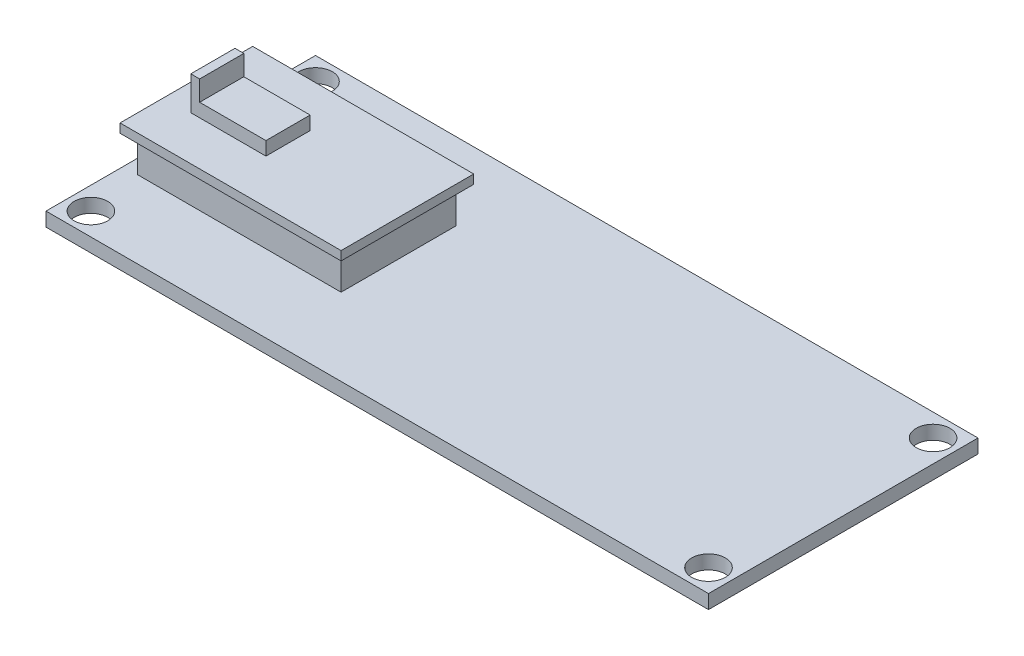
ISO-10303-21;
HEADER;
FILE_DESCRIPTION(('STEP AP214'),'2;1');
FILE_NAME('part.step','',(''),(''),'','','');
FILE_SCHEMA(('AUTOMOTIVE_DESIGN { 1 0 10303 214 1 1 1 1 }'));
ENDSEC;
DATA;
#1=APPLICATION_CONTEXT('core data for automotive mechanical design processes');
#2=APPLICATION_PROTOCOL_DEFINITION('international standard','automotive_design',2000,#1);
#3=PRODUCT_CONTEXT('',#1,'mechanical');
#4=PRODUCT('Part','Part','',(#3));
#5=PRODUCT_RELATED_PRODUCT_CATEGORY('part','',(#4));
#6=PRODUCT_DEFINITION_FORMATION('','',#4);
#7=PRODUCT_DEFINITION_CONTEXT('part definition',#1,'design');
#8=PRODUCT_DEFINITION('design','',#6,#7);
#9=PRODUCT_DEFINITION_SHAPE('','',#8);
#10=(LENGTH_UNIT() NAMED_UNIT(*) SI_UNIT(.MILLI.,.METRE.));
#11=(NAMED_UNIT(*) PLANE_ANGLE_UNIT() SI_UNIT($,.RADIAN.));
#12=(NAMED_UNIT(*) SI_UNIT($,.STERADIAN.) SOLID_ANGLE_UNIT());
#13=UNCERTAINTY_MEASURE_WITH_UNIT(LENGTH_MEASURE(1.E-05),#10,'distance_accuracy_value','');
#14=(GEOMETRIC_REPRESENTATION_CONTEXT(3) GLOBAL_UNCERTAINTY_ASSIGNED_CONTEXT((#13)) GLOBAL_UNIT_ASSIGNED_CONTEXT((#10,
#11,#12)) REPRESENTATION_CONTEXT('',''));
#15=CARTESIAN_POINT('',(0.,0.,0.));
#16=DIRECTION('',(0.,0.,1.));
#17=DIRECTION('',(1.,0.,0.));
#18=AXIS2_PLACEMENT_3D('',#15,#16,#17);
#19=CARTESIAN_POINT('',(37.465,-1.5748,15.24));
#20=DIRECTION('',(1.,0.,0.));
#21=DIRECTION('',(0.,0.,-1.));
#22=AXIS2_PLACEMENT_3D('',#19,#20,#21);
#23=PLANE('',#22);
#24=DIRECTION('',(0.,0.,-1.));
#25=VECTOR('',#24,1.);
#26=CARTESIAN_POINT('',(37.465,0.,15.24));
#27=LINE('',#26,#25);
#28=CARTESIAN_POINT('',(37.465,0.,15.24));
#29=VERTEX_POINT('',#28);
#30=CARTESIAN_POINT('',(37.465,0.,-15.24));
#31=VERTEX_POINT('',#30);
#32=EDGE_CURVE('E304',#29,#31,#27,.T.);
#33=ORIENTED_EDGE('',*,*,#32,.F.);
#34=DIRECTION('',(0.,1.,0.));
#35=VECTOR('',#34,1.);
#36=CARTESIAN_POINT('',(37.465,-1.5748,15.24));
#37=LINE('',#36,#35);
#38=CARTESIAN_POINT('',(37.465,-1.5748,15.24));
#39=VERTEX_POINT('',#38);
#40=EDGE_CURVE('E11',#39,#29,#37,.T.);
#41=ORIENTED_EDGE('',*,*,#40,.F.);
#42=DIRECTION('',(0.,0.,-1.));
#43=VECTOR('',#42,1.);
#44=CARTESIAN_POINT('',(37.465,-1.5748,15.24));
#45=LINE('',#44,#43);
#46=CARTESIAN_POINT('',(37.465,-1.5748,-15.24));
#47=VERTEX_POINT('',#46);
#48=EDGE_CURVE('E307',#39,#47,#45,.T.);
#49=ORIENTED_EDGE('',*,*,#48,.T.);
#50=DIRECTION('',(0.,1.,0.));
#51=VECTOR('',#50,1.);
#52=CARTESIAN_POINT('',(37.465,-1.5748,-15.24));
#53=LINE('',#52,#51);
#54=EDGE_CURVE('E42',#47,#31,#53,.T.);
#55=ORIENTED_EDGE('',*,*,#54,.T.);
#56=EDGE_LOOP('',(#33,#41,#49,#55));
#57=FACE_BOUND('',#56,.T.);
#58=ADVANCED_FACE('F39',(#57),#23,.T.);
#59=CARTESIAN_POINT('',(-37.465,-1.5748,15.24));
#60=DIRECTION('',(0.,0.,1.));
#61=DIRECTION('',(1.,0.,0.));
#62=AXIS2_PLACEMENT_3D('',#59,#60,#61);
#63=PLANE('',#62);
#64=DIRECTION('',(1.,0.,0.));
#65=VECTOR('',#64,1.);
#66=CARTESIAN_POINT('',(-37.465,0.,15.24));
#67=LINE('',#66,#65);
#68=CARTESIAN_POINT('',(-37.465,0.,15.24));
#69=VERTEX_POINT('',#68);
#70=EDGE_CURVE('E311',#69,#29,#67,.T.);
#71=ORIENTED_EDGE('',*,*,#70,.F.);
#72=DIRECTION('',(0.,1.,0.));
#73=VECTOR('',#72,1.);
#74=CARTESIAN_POINT('',(-37.465,-1.5748,15.24));
#75=LINE('',#74,#73);
#76=CARTESIAN_POINT('',(-37.465,-1.5748,15.24));
#77=VERTEX_POINT('',#76);
#78=EDGE_CURVE('E47',#77,#69,#75,.T.);
#79=ORIENTED_EDGE('',*,*,#78,.F.);
#80=DIRECTION('',(1.,0.,0.));
#81=VECTOR('',#80,1.);
#82=CARTESIAN_POINT('',(-37.465,-1.5748,15.24));
#83=LINE('',#82,#81);
#84=EDGE_CURVE('E317',#77,#39,#83,.T.);
#85=ORIENTED_EDGE('',*,*,#84,.T.);
#86=ORIENTED_EDGE('',*,*,#40,.T.);
#87=EDGE_LOOP('',(#71,#79,#85,#86));
#88=FACE_BOUND('',#87,.T.);
#89=ADVANCED_FACE('F344',(#88),#63,.T.);
#90=CARTESIAN_POINT('',(-37.465,-1.5748,15.24));
#91=DIRECTION('',(-1.,0.,0.));
#92=DIRECTION('',(0.,0.,1.));
#93=AXIS2_PLACEMENT_3D('',#90,#91,#92);
#94=PLANE('',#93);
#95=DIRECTION('',(0.,0.,1.));
#96=VECTOR('',#95,1.);
#97=CARTESIAN_POINT('',(-37.465,0.,15.24));
#98=LINE('',#97,#96);
#99=CARTESIAN_POINT('',(-37.465,0.,-15.24));
#100=VERTEX_POINT('',#99);
#101=EDGE_CURVE('E325',#100,#69,#98,.T.);
#102=ORIENTED_EDGE('',*,*,#101,.F.);
#103=DIRECTION('',(0.,1.,0.));
#104=VECTOR('',#103,1.);
#105=CARTESIAN_POINT('',(-37.465,-1.5748,-15.24));
#106=LINE('',#105,#104);
#107=CARTESIAN_POINT('',(-37.465,-1.5748,-15.24));
#108=VERTEX_POINT('',#107);
#109=EDGE_CURVE('E330',#108,#100,#106,.T.);
#110=ORIENTED_EDGE('',*,*,#109,.F.);
#111=DIRECTION('',(0.,0.,1.));
#112=VECTOR('',#111,1.);
#113=CARTESIAN_POINT('',(-37.465,-1.5748,15.24));
#114=LINE('',#113,#112);
#115=EDGE_CURVE('E314',#108,#77,#114,.T.);
#116=ORIENTED_EDGE('',*,*,#115,.T.);
#117=ORIENTED_EDGE('',*,*,#78,.T.);
#118=EDGE_LOOP('',(#102,#110,#116,#117));
#119=FACE_BOUND('',#118,.T.);
#120=ADVANCED_FACE('F350',(#119),#94,.T.);
#121=CARTESIAN_POINT('',(-37.465,-1.5748,-15.24));
#122=DIRECTION('',(0.,0.,-1.));
#123=DIRECTION('',(-1.,0.,0.));
#124=AXIS2_PLACEMENT_3D('',#121,#122,#123);
#125=PLANE('',#124);
#126=DIRECTION('',(-1.,0.,0.));
#127=VECTOR('',#126,1.);
#128=CARTESIAN_POINT('',(-37.465,0.,-15.24));
#129=LINE('',#128,#127);
#130=EDGE_CURVE('E322',#31,#100,#129,.T.);
#131=ORIENTED_EDGE('',*,*,#130,.F.);
#132=ORIENTED_EDGE('',*,*,#54,.F.);
#133=DIRECTION('',(-1.,0.,0.));
#134=VECTOR('',#133,1.);
#135=CARTESIAN_POINT('',(-37.465,-1.5748,-15.24));
#136=LINE('',#135,#134);
#137=EDGE_CURVE('E310',#47,#108,#136,.T.);
#138=ORIENTED_EDGE('',*,*,#137,.T.);
#139=ORIENTED_EDGE('',*,*,#109,.T.);
#140=EDGE_LOOP('',(#131,#132,#138,#139));
#141=FACE_BOUND('',#140,.T.);
#142=ADVANCED_FACE('F338',(#141),#125,.T.);
#143=CARTESIAN_POINT('',(0.,-1.5748,0.));
#144=DIRECTION('',(0.,-1.,0.));
#145=DIRECTION('',(0.,0.,-1.));
#146=AXIS2_PLACEMENT_3D('',#143,#144,#145);
#147=PLANE('',#146);
#148=CARTESIAN_POINT('',(34.925,-1.5748,12.7));
#149=DIRECTION('',(0.,1.,0.));
#150=DIRECTION('',(0.,0.,1.));
#151=AXIS2_PLACEMENT_3D('',#148,#149,#150);
#152=CIRCLE('',#151,1.905);
#153=CARTESIAN_POINT('',(34.925,-1.5748,14.605));
#154=VERTEX_POINT('',#153);
#155=EDGE_CURVE('E283',#154,#154,#152,.T.);
#156=ORIENTED_EDGE('',*,*,#155,.T.);
#157=EDGE_LOOP('',(#156));
#158=FACE_BOUND('',#157,.T.);
#159=CARTESIAN_POINT('',(-34.925,-1.5748,12.7));
#160=DIRECTION('',(0.,1.,0.));
#161=DIRECTION('',(0.,0.,1.));
#162=AXIS2_PLACEMENT_3D('',#159,#160,#161);
#163=CIRCLE('',#162,1.905);
#164=CARTESIAN_POINT('',(-34.925,-1.5748,14.605));
#165=VERTEX_POINT('',#164);
#166=EDGE_CURVE('E289',#165,#165,#163,.T.);
#167=ORIENTED_EDGE('',*,*,#166,.T.);
#168=EDGE_LOOP('',(#167));
#169=FACE_BOUND('',#168,.T.);
#170=CARTESIAN_POINT('',(34.925,-1.5748,-12.7));
#171=DIRECTION('',(0.,1.,0.));
#172=DIRECTION('',(0.,0.,1.));
#173=AXIS2_PLACEMENT_3D('',#170,#171,#172);
#174=CIRCLE('',#173,1.905);
#175=CARTESIAN_POINT('',(34.925,-1.5748,-10.795));
#176=VERTEX_POINT('',#175);
#177=EDGE_CURVE('E295',#176,#176,#174,.T.);
#178=ORIENTED_EDGE('',*,*,#177,.T.);
#179=EDGE_LOOP('',(#178));
#180=FACE_BOUND('',#179,.T.);
#181=CARTESIAN_POINT('',(-34.925,-1.5748,-12.7));
#182=DIRECTION('',(0.,1.,0.));
#183=DIRECTION('',(0.,0.,1.));
#184=AXIS2_PLACEMENT_3D('',#181,#182,#183);
#185=CIRCLE('',#184,1.905);
#186=CARTESIAN_POINT('',(-34.925,-1.5748,-10.795));
#187=VERTEX_POINT('',#186);
#188=EDGE_CURVE('E301',#187,#187,#185,.T.);
#189=ORIENTED_EDGE('',*,*,#188,.T.);
#190=EDGE_LOOP('',(#189));
#191=FACE_BOUND('',#190,.T.);
#192=ORIENTED_EDGE('',*,*,#48,.F.);
#193=ORIENTED_EDGE('',*,*,#84,.F.);
#194=ORIENTED_EDGE('',*,*,#115,.F.);
#195=ORIENTED_EDGE('',*,*,#137,.F.);
#196=EDGE_LOOP('',(#192,#193,#194,#195));
#197=FACE_BOUND('',#196,.T.);
#198=ADVANCED_FACE('F347',(#158,#169,#180,#191,#197),#147,.T.);
#199=CARTESIAN_POINT('',(0.,0.,0.));
#200=DIRECTION('',(0.,-1.,0.));
#201=DIRECTION('',(0.,0.,-1.));
#202=AXIS2_PLACEMENT_3D('',#199,#200,#201);
#203=PLANE('',#202);
#204=CARTESIAN_POINT('',(34.925,0.,12.7));
#205=DIRECTION('',(0.,1.,0.));
#206=DIRECTION('',(0.,0.,1.));
#207=AXIS2_PLACEMENT_3D('',#204,#205,#206);
#208=CIRCLE('',#207,1.905);
#209=CARTESIAN_POINT('',(34.925,0.,14.605));
#210=VERTEX_POINT('',#209);
#211=EDGE_CURVE('E282',#210,#210,#208,.T.);
#212=ORIENTED_EDGE('',*,*,#211,.F.);
#213=EDGE_LOOP('',(#212));
#214=FACE_BOUND('',#213,.T.);
#215=CARTESIAN_POINT('',(-34.925,0.,12.7));
#216=DIRECTION('',(0.,1.,0.));
#217=DIRECTION('',(0.,0.,1.));
#218=AXIS2_PLACEMENT_3D('',#215,#216,#217);
#219=CIRCLE('',#218,1.905);
#220=CARTESIAN_POINT('',(-34.925,0.,14.605));
#221=VERTEX_POINT('',#220);
#222=EDGE_CURVE('E286',#221,#221,#219,.T.);
#223=ORIENTED_EDGE('',*,*,#222,.F.);
#224=EDGE_LOOP('',(#223));
#225=FACE_BOUND('',#224,.T.);
#226=CARTESIAN_POINT('',(34.925,0.,-12.7));
#227=DIRECTION('',(0.,1.,0.));
#228=DIRECTION('',(0.,0.,1.));
#229=AXIS2_PLACEMENT_3D('',#226,#227,#228);
#230=CIRCLE('',#229,1.905);
#231=CARTESIAN_POINT('',(34.925,0.,-10.795));
#232=VERTEX_POINT('',#231);
#233=EDGE_CURVE('E292',#232,#232,#230,.T.);
#234=ORIENTED_EDGE('',*,*,#233,.F.);
#235=EDGE_LOOP('',(#234));
#236=FACE_BOUND('',#235,.T.);
#237=CARTESIAN_POINT('',(-34.925,0.,-12.7));
#238=DIRECTION('',(0.,1.,0.));
#239=DIRECTION('',(0.,0.,1.));
#240=AXIS2_PLACEMENT_3D('',#237,#238,#239);
#241=CIRCLE('',#240,1.905);
#242=CARTESIAN_POINT('',(-34.925,0.,-10.795));
#243=VERTEX_POINT('',#242);
#244=EDGE_CURVE('E298',#243,#243,#241,.T.);
#245=ORIENTED_EDGE('',*,*,#244,.F.);
#246=EDGE_LOOP('',(#245));
#247=FACE_BOUND('',#246,.T.);
#248=ORIENTED_EDGE('',*,*,#32,.T.);
#249=ORIENTED_EDGE('',*,*,#130,.T.);
#250=ORIENTED_EDGE('',*,*,#101,.T.);
#251=ORIENTED_EDGE('',*,*,#70,.T.);
#252=EDGE_LOOP('',(#248,#249,#250,#251));
#253=FACE_BOUND('',#252,.T.);
#254=DIRECTION('',(-1.,0.,0.));
#255=VECTOR('',#254,1.);
#256=CARTESIAN_POINT('',(-35.83,0.,-6.5));
#257=LINE('',#256,#255);
#258=CARTESIAN_POINT('',(-12.83,0.,-6.5));
#259=VERTEX_POINT('',#258);
#260=CARTESIAN_POINT('',(-35.83,0.,-6.5));
#261=VERTEX_POINT('',#260);
#262=EDGE_CURVE('E227',#259,#261,#257,.T.);
#263=ORIENTED_EDGE('',*,*,#262,.F.);
#264=DIRECTION('',(0.,0.,-1.));
#265=VECTOR('',#264,1.);
#266=CARTESIAN_POINT('',(-12.83,0.,-6.5));
#267=LINE('',#266,#265);
#268=CARTESIAN_POINT('',(-12.83,0.,6.5));
#269=VERTEX_POINT('',#268);
#270=EDGE_CURVE('E224',#269,#259,#267,.T.);
#271=ORIENTED_EDGE('',*,*,#270,.F.);
#272=DIRECTION('',(1.,0.,0.));
#273=VECTOR('',#272,1.);
#274=CARTESIAN_POINT('',(-35.83,0.,6.5));
#275=LINE('',#274,#273);
#276=CARTESIAN_POINT('',(-35.83,0.,6.5));
#277=VERTEX_POINT('',#276);
#278=EDGE_CURVE('E220',#277,#269,#275,.T.);
#279=ORIENTED_EDGE('',*,*,#278,.F.);
#280=DIRECTION('',(0.,0.,1.));
#281=VECTOR('',#280,1.);
#282=CARTESIAN_POINT('',(-35.83,0.,-6.5));
#283=LINE('',#282,#281);
#284=EDGE_CURVE('E217',#261,#277,#283,.T.);
#285=ORIENTED_EDGE('',*,*,#284,.F.);
#286=EDGE_LOOP('',(#263,#271,#279,#285));
#287=FACE_BOUND('',#286,.T.);
#288=ADVANCED_FACE('F340',(#214,#225,#236,#247,#253,#287),#203,.F.);
#289=CARTESIAN_POINT('',(-34.925,-1.5748,-12.7));
#290=DIRECTION('',(0.,1.,0.));
#291=DIRECTION('',(0.,0.,1.));
#292=AXIS2_PLACEMENT_3D('',#289,#290,#291);
#293=CYLINDRICAL_SURFACE('',#292,1.905);
#294=ORIENTED_EDGE('',*,*,#188,.F.);
#295=EDGE_LOOP('',(#294));
#296=FACE_BOUND('',#295,.T.);
#297=ORIENTED_EDGE('',*,*,#244,.T.);
#298=EDGE_LOOP('',(#297));
#299=FACE_BOUND('',#298,.T.);
#300=ADVANCED_FACE('F391',(#296,#299),#293,.F.);
#301=CARTESIAN_POINT('',(34.925,-1.5748,-12.7));
#302=DIRECTION('',(0.,1.,0.));
#303=DIRECTION('',(0.,0.,1.));
#304=AXIS2_PLACEMENT_3D('',#301,#302,#303);
#305=CYLINDRICAL_SURFACE('',#304,1.905);
#306=ORIENTED_EDGE('',*,*,#177,.F.);
#307=EDGE_LOOP('',(#306));
#308=FACE_BOUND('',#307,.T.);
#309=ORIENTED_EDGE('',*,*,#233,.T.);
#310=EDGE_LOOP('',(#309));
#311=FACE_BOUND('',#310,.T.);
#312=ADVANCED_FACE('F396',(#308,#311),#305,.F.);
#313=CARTESIAN_POINT('',(-34.925,-1.5748,12.7));
#314=DIRECTION('',(0.,1.,0.));
#315=DIRECTION('',(0.,0.,1.));
#316=AXIS2_PLACEMENT_3D('',#313,#314,#315);
#317=CYLINDRICAL_SURFACE('',#316,1.905);
#318=ORIENTED_EDGE('',*,*,#166,.F.);
#319=EDGE_LOOP('',(#318));
#320=FACE_BOUND('',#319,.T.);
#321=ORIENTED_EDGE('',*,*,#222,.T.);
#322=EDGE_LOOP('',(#321));
#323=FACE_BOUND('',#322,.T.);
#324=ADVANCED_FACE('F406',(#320,#323),#317,.F.);
#325=CARTESIAN_POINT('',(34.925,-1.5748,12.7));
#326=DIRECTION('',(0.,1.,0.));
#327=DIRECTION('',(0.,0.,1.));
#328=AXIS2_PLACEMENT_3D('',#325,#326,#327);
#329=CYLINDRICAL_SURFACE('',#328,1.905);
#330=ORIENTED_EDGE('',*,*,#155,.F.);
#331=EDGE_LOOP('',(#330));
#332=FACE_BOUND('',#331,.T.);
#333=ORIENTED_EDGE('',*,*,#211,.T.);
#334=EDGE_LOOP('',(#333));
#335=FACE_BOUND('',#334,.T.);
#336=ADVANCED_FACE('F416',(#332,#335),#329,.F.);
#337=CARTESIAN_POINT('',(0.,4.064,0.));
#338=DIRECTION('',(0.,1.,0.));
#339=DIRECTION('',(0.,0.,1.));
#340=AXIS2_PLACEMENT_3D('',#337,#338,#339);
#341=PLANE('',#340);
#342=DIRECTION('',(0.,0.,1.));
#343=VECTOR('',#342,1.);
#344=CARTESIAN_POINT('',(-35.83,4.064,-6.5));
#345=LINE('',#344,#343);
#346=CARTESIAN_POINT('',(-35.83,4.064,-6.5));
#347=VERTEX_POINT('',#346);
#348=CARTESIAN_POINT('',(-35.83,4.064,6.5));
#349=VERTEX_POINT('',#348);
#350=EDGE_CURVE('E212',#347,#349,#345,.T.);
#351=ORIENTED_EDGE('',*,*,#350,.T.);
#352=DIRECTION('',(1.,0.,0.));
#353=VECTOR('',#352,1.);
#354=CARTESIAN_POINT('',(-35.83,4.064,6.5));
#355=LINE('',#354,#353);
#356=CARTESIAN_POINT('',(-12.83,4.064,6.5));
#357=VERTEX_POINT('',#356);
#358=EDGE_CURVE('E232',#349,#357,#355,.T.);
#359=ORIENTED_EDGE('',*,*,#358,.T.);
#360=DIRECTION('',(0.,0.,-1.));
#361=VECTOR('',#360,1.);
#362=CARTESIAN_POINT('',(-12.83,4.064,-6.5));
#363=LINE('',#362,#361);
#364=CARTESIAN_POINT('',(-12.83,4.064,-6.5));
#365=VERTEX_POINT('',#364);
#366=EDGE_CURVE('E235',#357,#365,#363,.T.);
#367=ORIENTED_EDGE('',*,*,#366,.T.);
#368=DIRECTION('',(-1.,0.,0.));
#369=VECTOR('',#368,1.);
#370=CARTESIAN_POINT('',(-35.83,4.064,-6.5));
#371=LINE('',#370,#369);
#372=EDGE_CURVE('E221',#365,#347,#371,.T.);
#373=ORIENTED_EDGE('',*,*,#372,.T.);
#374=EDGE_LOOP('',(#351,#359,#367,#373));
#375=FACE_BOUND('',#374,.T.);
#376=DIRECTION('',(0.,0.,1.));
#377=VECTOR('',#376,1.);
#378=CARTESIAN_POINT('',(-36.83,4.064,-7.5));
#379=LINE('',#378,#377);
#380=CARTESIAN_POINT('',(-36.83,4.064,-7.5));
#381=VERTEX_POINT('',#380);
#382=CARTESIAN_POINT('',(-36.83,4.064,7.5));
#383=VERTEX_POINT('',#382);
#384=EDGE_CURVE('E242',#381,#383,#379,.T.);
#385=ORIENTED_EDGE('',*,*,#384,.F.);
#386=DIRECTION('',(-1.,0.,0.));
#387=VECTOR('',#386,1.);
#388=CARTESIAN_POINT('',(-36.83,4.064,-7.5));
#389=LINE('',#388,#387);
#390=CARTESIAN_POINT('',(-11.83,4.064,-7.5));
#391=VERTEX_POINT('',#390);
#392=EDGE_CURVE('E257',#391,#381,#389,.T.);
#393=ORIENTED_EDGE('',*,*,#392,.F.);
#394=DIRECTION('',(0.,0.,-1.));
#395=VECTOR('',#394,1.);
#396=CARTESIAN_POINT('',(-11.83,4.064,-7.5));
#397=LINE('',#396,#395);
#398=CARTESIAN_POINT('',(-11.83,4.064,7.5));
#399=VERTEX_POINT('',#398);
#400=EDGE_CURVE('E254',#399,#391,#397,.T.);
#401=ORIENTED_EDGE('',*,*,#400,.F.);
#402=DIRECTION('',(1.,0.,0.));
#403=VECTOR('',#402,1.);
#404=CARTESIAN_POINT('',(-36.83,4.064,7.5));
#405=LINE('',#404,#403);
#406=EDGE_CURVE('E251',#383,#399,#405,.T.);
#407=ORIENTED_EDGE('',*,*,#406,.F.);
#408=EDGE_LOOP('',(#385,#393,#401,#407));
#409=FACE_BOUND('',#408,.T.);
#410=ADVANCED_FACE('F426',(#375,#409),#341,.F.);
#411=CARTESIAN_POINT('',(-35.83,0.,-6.5));
#412=DIRECTION('',(-1.,0.,0.));
#413=DIRECTION('',(0.,0.,1.));
#414=AXIS2_PLACEMENT_3D('',#411,#412,#413);
#415=PLANE('',#414);
#416=ORIENTED_EDGE('',*,*,#350,.F.);
#417=DIRECTION('',(0.,1.,0.));
#418=VECTOR('',#417,1.);
#419=CARTESIAN_POINT('',(-35.83,0.,-6.5));
#420=LINE('',#419,#418);
#421=EDGE_CURVE('E240',#261,#347,#420,.T.);
#422=ORIENTED_EDGE('',*,*,#421,.F.);
#423=ORIENTED_EDGE('',*,*,#284,.T.);
#424=DIRECTION('',(0.,1.,0.));
#425=VECTOR('',#424,1.);
#426=CARTESIAN_POINT('',(-35.83,0.,6.5));
#427=LINE('',#426,#425);
#428=EDGE_CURVE('E230',#277,#349,#427,.T.);
#429=ORIENTED_EDGE('',*,*,#428,.T.);
#430=EDGE_LOOP('',(#416,#422,#423,#429));
#431=FACE_BOUND('',#430,.T.);
#432=ADVANCED_FACE('F446',(#431),#415,.T.);
#433=CARTESIAN_POINT('',(-35.83,0.,-6.5));
#434=DIRECTION('',(0.,0.,-1.));
#435=DIRECTION('',(-1.,0.,0.));
#436=AXIS2_PLACEMENT_3D('',#433,#434,#435);
#437=PLANE('',#436);
#438=ORIENTED_EDGE('',*,*,#372,.F.);
#439=DIRECTION('',(0.,1.,0.));
#440=VECTOR('',#439,1.);
#441=CARTESIAN_POINT('',(-12.83,0.,-6.5));
#442=LINE('',#441,#440);
#443=EDGE_CURVE('E243',#259,#365,#442,.T.);
#444=ORIENTED_EDGE('',*,*,#443,.F.);
#445=ORIENTED_EDGE('',*,*,#262,.T.);
#446=ORIENTED_EDGE('',*,*,#421,.T.);
#447=EDGE_LOOP('',(#438,#444,#445,#446));
#448=FACE_BOUND('',#447,.T.);
#449=ADVANCED_FACE('F456',(#448),#437,.T.);
#450=CARTESIAN_POINT('',(-12.83,0.,-6.5));
#451=DIRECTION('',(1.,0.,0.));
#452=DIRECTION('',(0.,0.,-1.));
#453=AXIS2_PLACEMENT_3D('',#450,#451,#452);
#454=PLANE('',#453);
#455=ORIENTED_EDGE('',*,*,#366,.F.);
#456=DIRECTION('',(0.,1.,0.));
#457=VECTOR('',#456,1.);
#458=CARTESIAN_POINT('',(-12.83,0.,6.5));
#459=LINE('',#458,#457);
#460=EDGE_CURVE('E245',#269,#357,#459,.T.);
#461=ORIENTED_EDGE('',*,*,#460,.F.);
#462=ORIENTED_EDGE('',*,*,#270,.T.);
#463=ORIENTED_EDGE('',*,*,#443,.T.);
#464=EDGE_LOOP('',(#455,#461,#462,#463));
#465=FACE_BOUND('',#464,.T.);
#466=ADVANCED_FACE('F466',(#465),#454,.T.);
#467=CARTESIAN_POINT('',(-35.83,0.,6.5));
#468=DIRECTION('',(0.,0.,1.));
#469=DIRECTION('',(1.,0.,0.));
#470=AXIS2_PLACEMENT_3D('',#467,#468,#469);
#471=PLANE('',#470);
#472=ORIENTED_EDGE('',*,*,#358,.F.);
#473=ORIENTED_EDGE('',*,*,#428,.F.);
#474=ORIENTED_EDGE('',*,*,#278,.T.);
#475=ORIENTED_EDGE('',*,*,#460,.T.);
#476=EDGE_LOOP('',(#472,#473,#474,#475));
#477=FACE_BOUND('',#476,.T.);
#478=ADVANCED_FACE('F476',(#477),#471,.T.);
#479=CARTESIAN_POINT('',(0.,5.08,0.));
#480=DIRECTION('',(0.,1.,0.));
#481=DIRECTION('',(0.,0.,1.));
#482=AXIS2_PLACEMENT_3D('',#479,#480,#481);
#483=PLANE('',#482);
#484=DIRECTION('',(1.,0.,0.));
#485=VECTOR('',#484,1.);
#486=CARTESIAN_POINT('',(-33.83,5.08,-2.5));
#487=LINE('',#486,#485);
#488=CARTESIAN_POINT('',(-33.83,5.08,-2.5));
#489=VERTEX_POINT('',#488);
#490=CARTESIAN_POINT('',(-25.33,5.08,-2.5));
#491=VERTEX_POINT('',#490);
#492=EDGE_CURVE('E188',#489,#491,#487,.T.);
#493=ORIENTED_EDGE('',*,*,#492,.T.);
#494=DIRECTION('',(0.,0.,-1.));
#495=VECTOR('',#494,1.);
#496=CARTESIAN_POINT('',(-25.33,5.08,2.5));
#497=LINE('',#496,#495);
#498=CARTESIAN_POINT('',(-25.33,5.08,2.5));
#499=VERTEX_POINT('',#498);
#500=EDGE_CURVE('E192',#499,#491,#497,.T.);
#501=ORIENTED_EDGE('',*,*,#500,.F.);
#502=DIRECTION('',(1.,0.,0.));
#503=VECTOR('',#502,1.);
#504=CARTESIAN_POINT('',(-33.83,5.08,2.5));
#505=LINE('',#504,#503);
#506=CARTESIAN_POINT('',(-33.83,5.08,2.5));
#507=VERTEX_POINT('',#506);
#508=EDGE_CURVE('E207',#507,#499,#505,.T.);
#509=ORIENTED_EDGE('',*,*,#508,.F.);
#510=DIRECTION('',(0.,0.,-1.));
#511=VECTOR('',#510,1.);
#512=CARTESIAN_POINT('',(-33.83,5.08,2.5));
#513=LINE('',#512,#511);
#514=EDGE_CURVE('E200',#507,#489,#513,.T.);
#515=ORIENTED_EDGE('',*,*,#514,.T.);
#516=EDGE_LOOP('',(#493,#501,#509,#515));
#517=FACE_BOUND('',#516,.T.);
#518=DIRECTION('',(0.,0.,-1.));
#519=VECTOR('',#518,1.);
#520=CARTESIAN_POINT('',(-36.83,5.08,0.));
#521=LINE('',#520,#519);
#522=CARTESIAN_POINT('',(-36.83,5.08,7.5));
#523=VERTEX_POINT('',#522);
#524=CARTESIAN_POINT('',(-36.83,5.08,-7.5));
#525=VERTEX_POINT('',#524);
#526=EDGE_CURVE('E260',#523,#525,#521,.T.);
#527=ORIENTED_EDGE('',*,*,#526,.F.);
#528=DIRECTION('',(1.,0.,0.));
#529=VECTOR('',#528,1.);
#530=CARTESIAN_POINT('',(0.,5.08,7.5));
#531=LINE('',#530,#529);
#532=CARTESIAN_POINT('',(-11.83,5.08,7.5));
#533=VERTEX_POINT('',#532);
#534=EDGE_CURVE('E263',#523,#533,#531,.T.);
#535=ORIENTED_EDGE('',*,*,#534,.T.);
#536=DIRECTION('',(0.,0.,-1.));
#537=VECTOR('',#536,1.);
#538=CARTESIAN_POINT('',(-11.83,5.08,0.));
#539=LINE('',#538,#537);
#540=CARTESIAN_POINT('',(-11.83,5.08,-7.5));
#541=VERTEX_POINT('',#540);
#542=EDGE_CURVE('E265',#533,#541,#539,.T.);
#543=ORIENTED_EDGE('',*,*,#542,.T.);
#544=DIRECTION('',(1.,0.,0.));
#545=VECTOR('',#544,1.);
#546=CARTESIAN_POINT('',(0.,5.08,-7.5));
#547=LINE('',#546,#545);
#548=EDGE_CURVE('E267',#525,#541,#547,.T.);
#549=ORIENTED_EDGE('',*,*,#548,.F.);
#550=EDGE_LOOP('',(#527,#535,#543,#549));
#551=FACE_BOUND('',#550,.T.);
#552=ADVANCED_FACE('F486',(#517,#551),#483,.T.);
#553=CARTESIAN_POINT('',(0.,5.08,-7.5));
#554=DIRECTION('',(0.,0.,-1.));
#555=DIRECTION('',(-1.,0.,0.));
#556=AXIS2_PLACEMENT_3D('',#553,#554,#555);
#557=PLANE('',#556);
#558=ORIENTED_EDGE('',*,*,#392,.T.);
#559=DIRECTION('',(0.,-1.,0.));
#560=VECTOR('',#559,1.);
#561=CARTESIAN_POINT('',(-36.83,5.08,-7.5));
#562=LINE('',#561,#560);
#563=EDGE_CURVE('E270',#525,#381,#562,.T.);
#564=ORIENTED_EDGE('',*,*,#563,.F.);
#565=ORIENTED_EDGE('',*,*,#548,.T.);
#566=DIRECTION('',(0.,-1.,0.));
#567=VECTOR('',#566,1.);
#568=CARTESIAN_POINT('',(-11.83,5.08,-7.5));
#569=LINE('',#568,#567);
#570=EDGE_CURVE('E273',#541,#391,#569,.T.);
#571=ORIENTED_EDGE('',*,*,#570,.T.);
#572=EDGE_LOOP('',(#558,#564,#565,#571));
#573=FACE_BOUND('',#572,.T.);
#574=ADVANCED_FACE('F494',(#573),#557,.T.);
#575=CARTESIAN_POINT('',(-11.83,5.08,0.));
#576=DIRECTION('',(-1.,0.,0.));
#577=DIRECTION('',(0.,0.,1.));
#578=AXIS2_PLACEMENT_3D('',#575,#576,#577);
#579=PLANE('',#578);
#580=DIRECTION('',(0.,-1.,0.));
#581=VECTOR('',#580,1.);
#582=CARTESIAN_POINT('',(-11.83,5.08,7.5));
#583=LINE('',#582,#581);
#584=EDGE_CURVE('E276',#533,#399,#583,.T.);
#585=ORIENTED_EDGE('',*,*,#584,.T.);
#586=ORIENTED_EDGE('',*,*,#400,.T.);
#587=ORIENTED_EDGE('',*,*,#570,.F.);
#588=ORIENTED_EDGE('',*,*,#542,.F.);
#589=EDGE_LOOP('',(#585,#586,#587,#588));
#590=FACE_BOUND('',#589,.T.);
#591=ADVANCED_FACE('F499',(#590),#579,.F.);
#592=CARTESIAN_POINT('',(0.,5.08,7.5));
#593=DIRECTION('',(0.,0.,-1.));
#594=DIRECTION('',(-1.,0.,0.));
#595=AXIS2_PLACEMENT_3D('',#592,#593,#594);
#596=PLANE('',#595);
#597=DIRECTION('',(0.,-1.,0.));
#598=VECTOR('',#597,1.);
#599=CARTESIAN_POINT('',(-36.83,5.08,7.5));
#600=LINE('',#599,#598);
#601=EDGE_CURVE('E279',#523,#383,#600,.T.);
#602=ORIENTED_EDGE('',*,*,#601,.T.);
#603=ORIENTED_EDGE('',*,*,#406,.T.);
#604=ORIENTED_EDGE('',*,*,#584,.F.);
#605=ORIENTED_EDGE('',*,*,#534,.F.);
#606=EDGE_LOOP('',(#602,#603,#604,#605));
#607=FACE_BOUND('',#606,.T.);
#608=ADVANCED_FACE('F510',(#607),#596,.F.);
#609=CARTESIAN_POINT('',(-36.83,5.08,0.));
#610=DIRECTION('',(-1.,0.,0.));
#611=DIRECTION('',(0.,0.,1.));
#612=AXIS2_PLACEMENT_3D('',#609,#610,#611);
#613=PLANE('',#612);
#614=ORIENTED_EDGE('',*,*,#384,.T.);
#615=ORIENTED_EDGE('',*,*,#601,.F.);
#616=ORIENTED_EDGE('',*,*,#526,.T.);
#617=ORIENTED_EDGE('',*,*,#563,.T.);
#618=EDGE_LOOP('',(#614,#615,#616,#617));
#619=FACE_BOUND('',#618,.T.);
#620=ADVANCED_FACE('F520',(#619),#613,.T.);
#621=CARTESIAN_POINT('',(-33.83,6.604,-2.5));
#622=DIRECTION('',(0.,0.,-1.));
#623=DIRECTION('',(-1.,0.,0.));
#624=AXIS2_PLACEMENT_3D('',#621,#622,#623);
#625=PLANE('',#624);
#626=ORIENTED_EDGE('',*,*,#492,.F.);
#627=DIRECTION('',(0.,-1.,0.));
#628=VECTOR('',#627,1.);
#629=CARTESIAN_POINT('',(-33.83,6.604,-2.5));
#630=LINE('',#629,#628);
#631=CARTESIAN_POINT('',(-33.83,8.89,-2.5));
#632=VERTEX_POINT('',#631);
#633=EDGE_CURVE('E172',#632,#489,#630,.T.);
#634=ORIENTED_EDGE('',*,*,#633,.F.);
#635=DIRECTION('',(-1.,0.,0.));
#636=VECTOR('',#635,1.);
#637=CARTESIAN_POINT('',(-32.83,8.89,-2.5));
#638=LINE('',#637,#636);
#639=CARTESIAN_POINT('',(-32.83,8.89,-2.5));
#640=VERTEX_POINT('',#639);
#641=EDGE_CURVE('E166',#640,#632,#638,.T.);
#642=ORIENTED_EDGE('',*,*,#641,.F.);
#643=DIRECTION('',(0.,-1.,0.));
#644=VECTOR('',#643,1.);
#645=CARTESIAN_POINT('',(-32.83,8.89,-2.5));
#646=LINE('',#645,#644);
#647=CARTESIAN_POINT('',(-32.83,6.604,-2.5));
#648=VERTEX_POINT('',#647);
#649=EDGE_CURVE('E171',#640,#648,#646,.T.);
#650=ORIENTED_EDGE('',*,*,#649,.T.);
#651=DIRECTION('',(1.,0.,0.));
#652=VECTOR('',#651,1.);
#653=CARTESIAN_POINT('',(-33.83,6.604,-2.5));
#654=LINE('',#653,#652);
#655=CARTESIAN_POINT('',(-25.33,6.604,-2.5));
#656=VERTEX_POINT('',#655);
#657=EDGE_CURVE('E197',#648,#656,#654,.T.);
#658=ORIENTED_EDGE('',*,*,#657,.T.);
#659=DIRECTION('',(0.,-1.,0.));
#660=VECTOR('',#659,1.);
#661=CARTESIAN_POINT('',(-25.33,6.604,-2.5));
#662=LINE('',#661,#660);
#663=EDGE_CURVE('E204',#656,#491,#662,.T.);
#664=ORIENTED_EDGE('',*,*,#663,.T.);
#665=EDGE_LOOP('',(#626,#634,#642,#650,#658,#664));
#666=FACE_BOUND('',#665,.T.);
#667=ADVANCED_FACE('F169',(#666),#625,.T.);
#668=CARTESIAN_POINT('',(-33.83,6.604,2.5));
#669=DIRECTION('',(-1.,0.,0.));
#670=DIRECTION('',(0.,0.,1.));
#671=AXIS2_PLACEMENT_3D('',#668,#669,#670);
#672=PLANE('',#671);
#673=ORIENTED_EDGE('',*,*,#514,.F.);
#674=DIRECTION('',(0.,-1.,0.));
#675=VECTOR('',#674,1.);
#676=CARTESIAN_POINT('',(-33.83,6.604,2.5));
#677=LINE('',#676,#675);
#678=CARTESIAN_POINT('',(-33.83,8.89,2.5));
#679=VERTEX_POINT('',#678);
#680=EDGE_CURVE('E213',#679,#507,#677,.T.);
#681=ORIENTED_EDGE('',*,*,#680,.F.);
#682=DIRECTION('',(0.,0.,1.));
#683=VECTOR('',#682,1.);
#684=CARTESIAN_POINT('',(-33.83,8.89,2.5));
#685=LINE('',#684,#683);
#686=EDGE_CURVE('E176',#632,#679,#685,.T.);
#687=ORIENTED_EDGE('',*,*,#686,.F.);
#688=ORIENTED_EDGE('',*,*,#633,.T.);
#689=EDGE_LOOP('',(#673,#681,#687,#688));
#690=FACE_BOUND('',#689,.T.);
#691=ADVANCED_FACE('F560',(#690),#672,.T.);
#692=CARTESIAN_POINT('',(-33.83,6.604,2.5));
#693=DIRECTION('',(0.,0.,-1.));
#694=DIRECTION('',(-1.,0.,0.));
#695=AXIS2_PLACEMENT_3D('',#692,#693,#694);
#696=PLANE('',#695);
#697=ORIENTED_EDGE('',*,*,#508,.T.);
#698=DIRECTION('',(0.,-1.,0.));
#699=VECTOR('',#698,1.);
#700=CARTESIAN_POINT('',(-25.33,6.604,2.5));
#701=LINE('',#700,#699);
#702=CARTESIAN_POINT('',(-25.33,6.604,2.5));
#703=VERTEX_POINT('',#702);
#704=EDGE_CURVE('E63',#703,#499,#701,.T.);
#705=ORIENTED_EDGE('',*,*,#704,.F.);
#706=DIRECTION('',(1.,0.,0.));
#707=VECTOR('',#706,1.);
#708=CARTESIAN_POINT('',(-33.83,6.604,2.5));
#709=LINE('',#708,#707);
#710=CARTESIAN_POINT('',(-32.83,6.604,2.5));
#711=VERTEX_POINT('',#710);
#712=EDGE_CURVE('E203',#711,#703,#709,.T.);
#713=ORIENTED_EDGE('',*,*,#712,.F.);
#714=DIRECTION('',(0.,-1.,0.));
#715=VECTOR('',#714,1.);
#716=CARTESIAN_POINT('',(-32.83,8.89,2.5));
#717=LINE('',#716,#715);
#718=CARTESIAN_POINT('',(-32.83,8.89,2.5));
#719=VERTEX_POINT('',#718);
#720=EDGE_CURVE('E189',#719,#711,#717,.T.);
#721=ORIENTED_EDGE('',*,*,#720,.F.);
#722=DIRECTION('',(1.,0.,0.));
#723=VECTOR('',#722,1.);
#724=CARTESIAN_POINT('',(-32.83,8.89,2.5));
#725=LINE('',#724,#723);
#726=EDGE_CURVE('E182',#679,#719,#725,.T.);
#727=ORIENTED_EDGE('',*,*,#726,.F.);
#728=ORIENTED_EDGE('',*,*,#680,.T.);
#729=EDGE_LOOP('',(#697,#705,#713,#721,#727,#728));
#730=FACE_BOUND('',#729,.T.);
#731=ADVANCED_FACE('F548',(#730),#696,.F.);
#732=CARTESIAN_POINT('',(-25.33,6.604,2.5));
#733=DIRECTION('',(-1.,0.,0.));
#734=DIRECTION('',(0.,0.,1.));
#735=AXIS2_PLACEMENT_3D('',#732,#733,#734);
#736=PLANE('',#735);
#737=ORIENTED_EDGE('',*,*,#500,.T.);
#738=ORIENTED_EDGE('',*,*,#663,.F.);
#739=DIRECTION('',(0.,0.,-1.));
#740=VECTOR('',#739,1.);
#741=CARTESIAN_POINT('',(-25.33,6.604,2.5));
#742=LINE('',#741,#740);
#743=EDGE_CURVE('E199',#703,#656,#742,.T.);
#744=ORIENTED_EDGE('',*,*,#743,.F.);
#745=ORIENTED_EDGE('',*,*,#704,.T.);
#746=EDGE_LOOP('',(#737,#738,#744,#745));
#747=FACE_BOUND('',#746,.T.);
#748=ADVANCED_FACE('F542',(#747),#736,.F.);
#749=CARTESIAN_POINT('',(0.,6.604,0.));
#750=DIRECTION('',(0.,1.,0.));
#751=DIRECTION('',(0.,0.,1.));
#752=AXIS2_PLACEMENT_3D('',#749,#750,#751);
#753=PLANE('',#752);
#754=DIRECTION('',(0.,0.,-1.));
#755=VECTOR('',#754,1.);
#756=CARTESIAN_POINT('',(-32.83,6.604,2.5));
#757=LINE('',#756,#755);
#758=EDGE_CURVE('E55',#711,#648,#757,.T.);
#759=ORIENTED_EDGE('',*,*,#758,.F.);
#760=ORIENTED_EDGE('',*,*,#712,.T.);
#761=ORIENTED_EDGE('',*,*,#743,.T.);
#762=ORIENTED_EDGE('',*,*,#657,.F.);
#763=EDGE_LOOP('',(#759,#760,#761,#762));
#764=FACE_BOUND('',#763,.T.);
#765=ADVANCED_FACE('F547',(#764),#753,.T.);
#766=CARTESIAN_POINT('',(-32.83,8.89,2.5));
#767=DIRECTION('',(-1.,0.,0.));
#768=DIRECTION('',(0.,0.,1.));
#769=AXIS2_PLACEMENT_3D('',#766,#767,#768);
#770=PLANE('',#769);
#771=ORIENTED_EDGE('',*,*,#758,.T.);
#772=ORIENTED_EDGE('',*,*,#649,.F.);
#773=DIRECTION('',(0.,0.,-1.));
#774=VECTOR('',#773,1.);
#775=CARTESIAN_POINT('',(-32.83,8.89,2.5));
#776=LINE('',#775,#774);
#777=EDGE_CURVE('E177',#719,#640,#776,.T.);
#778=ORIENTED_EDGE('',*,*,#777,.F.);
#779=ORIENTED_EDGE('',*,*,#720,.T.);
#780=EDGE_LOOP('',(#771,#772,#778,#779));
#781=FACE_BOUND('',#780,.T.);
#782=ADVANCED_FACE('F187',(#781),#770,.F.);
#783=CARTESIAN_POINT('',(0.,8.89,0.));
#784=DIRECTION('',(0.,1.,0.));
#785=DIRECTION('',(0.,0.,1.));
#786=AXIS2_PLACEMENT_3D('',#783,#784,#785);
#787=PLANE('',#786);
#788=ORIENTED_EDGE('',*,*,#777,.T.);
#789=ORIENTED_EDGE('',*,*,#641,.T.);
#790=ORIENTED_EDGE('',*,*,#686,.T.);
#791=ORIENTED_EDGE('',*,*,#726,.T.);
#792=EDGE_LOOP('',(#788,#789,#790,#791));
#793=FACE_BOUND('',#792,.T.);
#794=ADVANCED_FACE('F180',(#793),#787,.T.);
#795=CLOSED_SHELL('',(#58,#89,#120,#142,#198,#288,#300,#312,#324,#336,#410,#432,#449,#466,#478,
#552,#574,#591,#608,#620,#667,#691,#731,#748,#765,#782,#794));
#796=MANIFOLD_SOLID_BREP('B2',#795);
#797=ADVANCED_BREP_SHAPE_REPRESENTATION('',(#18,#796),#14);
#798=SHAPE_DEFINITION_REPRESENTATION(#9,#797);
ENDSEC;
END-ISO-10303-21;
